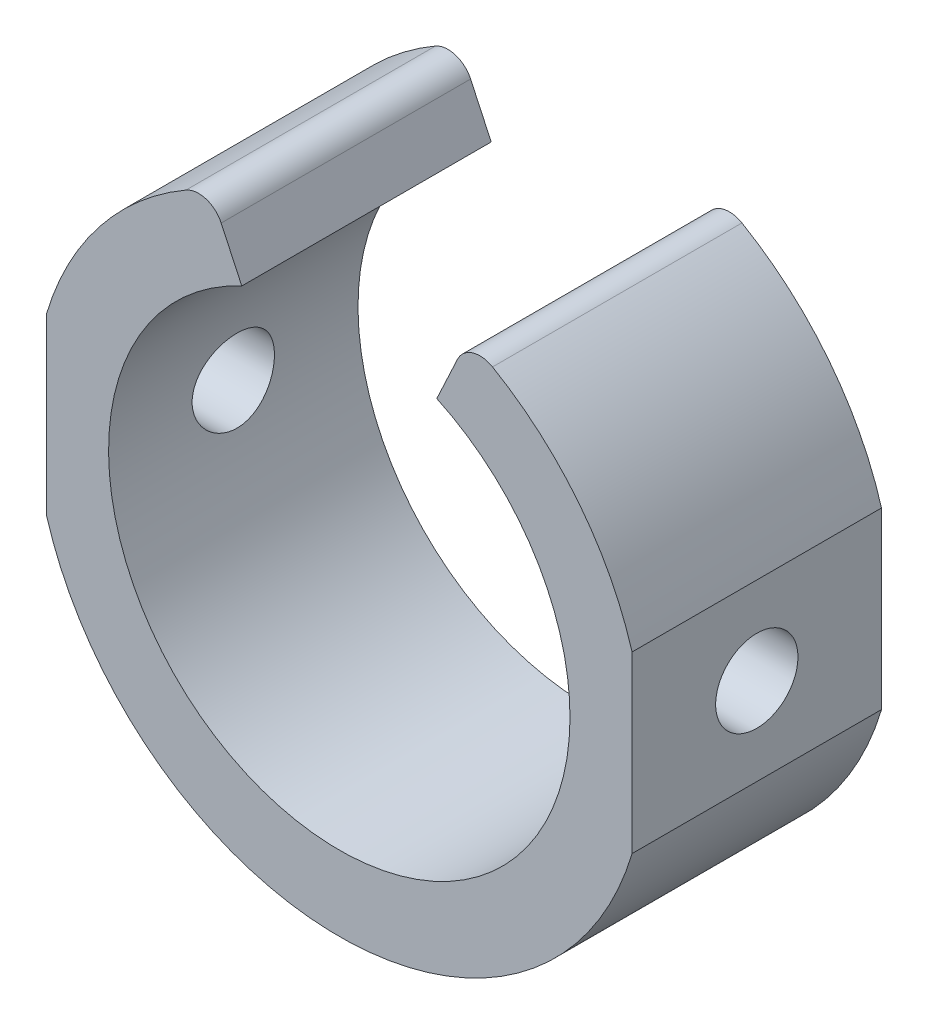
ISO-10303-21;
HEADER;
FILE_DESCRIPTION(('STEP AP214'),'2;1');
FILE_NAME('part.step','',(''),(''),'','','');
FILE_SCHEMA(('AUTOMOTIVE_DESIGN { 1 0 10303 214 1 1 1 1 }'));
ENDSEC;
DATA;
#1=APPLICATION_CONTEXT('core data for automotive mechanical design processes');
#2=APPLICATION_PROTOCOL_DEFINITION('international standard','automotive_design',2000,#1);
#3=PRODUCT_CONTEXT('',#1,'mechanical');
#4=PRODUCT('Part','Part','',(#3));
#5=PRODUCT_RELATED_PRODUCT_CATEGORY('part','',(#4));
#6=PRODUCT_DEFINITION_FORMATION('','',#4);
#7=PRODUCT_DEFINITION_CONTEXT('part definition',#1,'design');
#8=PRODUCT_DEFINITION('design','',#6,#7);
#9=PRODUCT_DEFINITION_SHAPE('','',#8);
#10=(LENGTH_UNIT() NAMED_UNIT(*) SI_UNIT(.MILLI.,.METRE.));
#11=(NAMED_UNIT(*) PLANE_ANGLE_UNIT() SI_UNIT($,.RADIAN.));
#12=(NAMED_UNIT(*) SI_UNIT($,.STERADIAN.) SOLID_ANGLE_UNIT());
#13=UNCERTAINTY_MEASURE_WITH_UNIT(LENGTH_MEASURE(1.E-05),#10,'distance_accuracy_value','');
#14=(GEOMETRIC_REPRESENTATION_CONTEXT(3) GLOBAL_UNCERTAINTY_ASSIGNED_CONTEXT((#13)) GLOBAL_UNIT_ASSIGNED_CONTEXT((#10,
#11,#12)) REPRESENTATION_CONTEXT('',''));
#15=CARTESIAN_POINT('',(0.,0.,0.));
#16=DIRECTION('',(0.,0.,1.));
#17=DIRECTION('',(1.,0.,0.));
#18=AXIS2_PLACEMENT_3D('',#15,#16,#17);
#19=CARTESIAN_POINT('',(0.,0.,10.));
#20=DIRECTION('',(0.,0.,-1.));
#21=DIRECTION('',(-1.,0.,0.));
#22=AXIS2_PLACEMENT_3D('',#19,#20,#21);
#23=CYLINDRICAL_SURFACE('',#22,12.25);
#24=CARTESIAN_POINT('',(0.,0.,10.));
#25=DIRECTION('',(0.,0.,1.));
#26=DIRECTION('',(1.,0.,0.));
#27=AXIS2_PLACEMENT_3D('',#24,#25,#26);
#28=CIRCLE('',#27,12.25);
#29=CARTESIAN_POINT('',(-11.7393568818739,-3.5,10.));
#30=VERTEX_POINT('',#29);
#31=CARTESIAN_POINT('',(11.7393568818739,-3.5,10.));
#32=VERTEX_POINT('',#31);
#33=EDGE_CURVE('E172',#30,#32,#28,.T.);
#34=ORIENTED_EDGE('',*,*,#33,.F.);
#35=DIRECTION('',(0.,0.,1.));
#36=VECTOR('',#35,1.);
#37=CARTESIAN_POINT('',(-11.7393568818739,-3.5,0.));
#38=LINE('',#37,#36);
#39=CARTESIAN_POINT('',(-11.7393568818739,-3.5,0.));
#40=VERTEX_POINT('',#39);
#41=EDGE_CURVE('E127',#40,#30,#38,.T.);
#42=ORIENTED_EDGE('',*,*,#41,.F.);
#43=CARTESIAN_POINT('',(0.,0.,0.));
#44=DIRECTION('',(0.,0.,1.));
#45=DIRECTION('',(1.,0.,0.));
#46=AXIS2_PLACEMENT_3D('',#43,#44,#45);
#47=CIRCLE('',#46,12.25);
#48=CARTESIAN_POINT('',(11.7393568818739,-3.5,0.));
#49=VERTEX_POINT('',#48);
#50=EDGE_CURVE('E117',#40,#49,#47,.T.);
#51=ORIENTED_EDGE('',*,*,#50,.T.);
#52=DIRECTION('',(0.,0.,1.));
#53=VECTOR('',#52,1.);
#54=CARTESIAN_POINT('',(11.7393568818739,-3.5,0.));
#55=LINE('',#54,#53);
#56=EDGE_CURVE('E150',#49,#32,#55,.T.);
#57=ORIENTED_EDGE('',*,*,#56,.T.);
#58=EDGE_LOOP('',(#34,#42,#51,#57));
#59=FACE_BOUND('',#58,.T.);
#60=ADVANCED_FACE('F33',(#59),#23,.T.);
#61=CARTESIAN_POINT('',(11.7393568818739,3.5,0.));
#62=VERTEX_POINT('',#61);
#63=CARTESIAN_POINT('',(6.14344898800786,10.5981382578142,0.));
#64=VERTEX_POINT('',#63);
#65=EDGE_CURVE('E119',#62,#64,#47,.T.);
#66=ORIENTED_EDGE('',*,*,#65,.T.);
#67=DIRECTION('',(0.,0.,-1.));
#68=VECTOR('',#67,1.);
#69=CARTESIAN_POINT('',(6.14344898800786,10.5981382578142,10.));
#70=LINE('',#69,#68);
#71=CARTESIAN_POINT('',(6.14344898800786,10.5981382578142,10.));
#72=VERTEX_POINT('',#71);
#73=EDGE_CURVE('E186',#64,#72,#70,.F.);
#74=ORIENTED_EDGE('',*,*,#73,.T.);
#75=CARTESIAN_POINT('',(11.7393568818739,3.5,10.));
#76=VERTEX_POINT('',#75);
#77=EDGE_CURVE('E116',#76,#72,#28,.T.);
#78=ORIENTED_EDGE('',*,*,#77,.F.);
#79=DIRECTION('',(0.,0.,1.));
#80=VECTOR('',#79,1.);
#81=CARTESIAN_POINT('',(11.7393568818739,3.5,0.));
#82=LINE('',#81,#80);
#83=EDGE_CURVE('E135',#62,#76,#82,.T.);
#84=ORIENTED_EDGE('',*,*,#83,.F.);
#85=EDGE_LOOP('',(#66,#74,#78,#84));
#86=FACE_BOUND('',#85,.T.);
#87=ADVANCED_FACE('F209',(#86),#23,.T.);
#88=CARTESIAN_POINT('',(0.,0.,55.0780573006424));
#89=DIRECTION('',(0.906307787036649,0.422618261740701,0.));
#90=DIRECTION('',(-0.422618261740701,0.906307787036649,0.));
#91=AXIS2_PLACEMENT_3D('',#88,#89,#90);
#92=PLANE('',#91);
#93=DIRECTION('',(-0.422618261740701,0.906307787036649,0.));
#94=VECTOR('',#93,1.);
#95=CARTESIAN_POINT('',(0.,0.,0.));
#96=LINE('',#95,#94);
#97=CARTESIAN_POINT('',(-3.90921892110148,8.38334703008901,0.));
#98=VERTEX_POINT('',#97);
#99=CARTESIAN_POINT('',(-4.73563516113384,10.1556023760599,0.));
#100=VERTEX_POINT('',#99);
#101=EDGE_CURVE('E159',#98,#100,#96,.T.);
#102=ORIENTED_EDGE('',*,*,#101,.T.);
#103=DIRECTION('',(0.,0.,1.));
#104=VECTOR('',#103,1.);
#105=CARTESIAN_POINT('',(-4.73563516113384,10.1556023760599,10.));
#106=LINE('',#105,#104);
#107=CARTESIAN_POINT('',(-4.73563516113384,10.1556023760599,10.));
#108=VERTEX_POINT('',#107);
#109=EDGE_CURVE('E41',#100,#108,#106,.T.);
#110=ORIENTED_EDGE('',*,*,#109,.T.);
#111=DIRECTION('',(-0.422618261740701,0.906307787036649,0.));
#112=VECTOR('',#111,1.);
#113=CARTESIAN_POINT('',(0.,0.,10.));
#114=LINE('',#113,#112);
#115=CARTESIAN_POINT('',(-3.90921892110148,8.38334703008901,10.));
#116=VERTEX_POINT('',#115);
#117=EDGE_CURVE('E162',#116,#108,#114,.T.);
#118=ORIENTED_EDGE('',*,*,#117,.F.);
#119=DIRECTION('',(0.,0.,-1.));
#120=VECTOR('',#119,1.);
#121=CARTESIAN_POINT('',(-3.90921892110148,8.38334703008901,10.));
#122=LINE('',#121,#120);
#123=EDGE_CURVE('E176',#98,#116,#122,.F.);
#124=ORIENTED_EDGE('',*,*,#123,.F.);
#125=EDGE_LOOP('',(#102,#110,#118,#124));
#126=FACE_BOUND('',#125,.T.);
#127=ADVANCED_FACE('F191',(#126),#92,.T.);
#128=CARTESIAN_POINT('',(0.,0.,10.));
#129=DIRECTION('',(0.,0.,1.));
#130=DIRECTION('',(1.,0.,0.));
#131=AXIS2_PLACEMENT_3D('',#128,#129,#130);
#132=PLANE('',#131);
#133=ORIENTED_EDGE('',*,*,#77,.T.);
#134=CARTESIAN_POINT('',(5.64194294817049,9.73298411431917,10.));
#135=DIRECTION('',(0.,0.,1.));
#136=DIRECTION('',(1.,0.,0.));
#137=AXIS2_PLACEMENT_3D('',#134,#135,#136);
#138=CIRCLE('',#137,1.);
#139=CARTESIAN_POINT('',(4.73563516113384,10.1556023760599,10.));
#140=VERTEX_POINT('',#139);
#141=EDGE_CURVE('E189',#72,#140,#138,.T.);
#142=ORIENTED_EDGE('',*,*,#141,.T.);
#143=DIRECTION('',(-0.422618261740701,-0.906307787036649,0.));
#144=VECTOR('',#143,1.);
#145=CARTESIAN_POINT('',(0.,0.,10.));
#146=LINE('',#145,#144);
#147=CARTESIAN_POINT('',(3.90921892110148,8.38334703008901,10.));
#148=VERTEX_POINT('',#147);
#149=EDGE_CURVE('E157',#140,#148,#146,.T.);
#150=ORIENTED_EDGE('',*,*,#149,.T.);
#151=CARTESIAN_POINT('',(0.,0.,10.));
#152=DIRECTION('',(0.,0.,1.));
#153=DIRECTION('',(1.,0.,0.));
#154=AXIS2_PLACEMENT_3D('',#151,#152,#153);
#155=CIRCLE('',#154,9.25);
#156=EDGE_CURVE('E165',#116,#148,#155,.T.);
#157=ORIENTED_EDGE('',*,*,#156,.F.);
#158=ORIENTED_EDGE('',*,*,#117,.T.);
#159=CARTESIAN_POINT('',(-5.64194294817049,9.73298411431917,10.));
#160=DIRECTION('',(0.,0.,1.));
#161=DIRECTION('',(1.,0.,0.));
#162=AXIS2_PLACEMENT_3D('',#159,#160,#161);
#163=CIRCLE('',#162,1.);
#164=CARTESIAN_POINT('',(-6.14344898800786,10.5981382578142,10.));
#165=VERTEX_POINT('',#164);
#166=EDGE_CURVE('E48',#108,#165,#163,.T.);
#167=ORIENTED_EDGE('',*,*,#166,.T.);
#168=CARTESIAN_POINT('',(-11.7393568818739,3.5,10.));
#169=VERTEX_POINT('',#168);
#170=EDGE_CURVE('E170',#165,#169,#28,.T.);
#171=ORIENTED_EDGE('',*,*,#170,.T.);
#172=DIRECTION('',(0.,1.,0.));
#173=VECTOR('',#172,1.);
#174=CARTESIAN_POINT('',(-11.7393568818739,-3.5,10.));
#175=LINE('',#174,#173);
#176=EDGE_CURVE('E126',#30,#169,#175,.T.);
#177=ORIENTED_EDGE('',*,*,#176,.F.);
#178=ORIENTED_EDGE('',*,*,#33,.T.);
#179=DIRECTION('',(0.,-1.,0.));
#180=VECTOR('',#179,1.);
#181=CARTESIAN_POINT('',(11.7393568818739,-3.5,10.));
#182=LINE('',#181,#180);
#183=EDGE_CURVE('E151',#76,#32,#182,.T.);
#184=ORIENTED_EDGE('',*,*,#183,.F.);
#185=EDGE_LOOP('',(#133,#142,#150,#157,#158,#167,#171,#177,#178,#184));
#186=FACE_BOUND('',#185,.T.);
#187=ADVANCED_FACE('F195',(#186),#132,.T.);
#188=CARTESIAN_POINT('',(0.,0.,0.));
#189=DIRECTION('',(0.,0.,1.));
#190=DIRECTION('',(1.,0.,0.));
#191=AXIS2_PLACEMENT_3D('',#188,#189,#190);
#192=PLANE('',#191);
#193=DIRECTION('',(-0.422618261740701,-0.906307787036649,0.));
#194=VECTOR('',#193,1.);
#195=CARTESIAN_POINT('',(0.,0.,0.));
#196=LINE('',#195,#194);
#197=CARTESIAN_POINT('',(4.73563516113384,10.1556023760599,0.));
#198=VERTEX_POINT('',#197);
#199=CARTESIAN_POINT('',(3.90921892110148,8.38334703008901,0.));
#200=VERTEX_POINT('',#199);
#201=EDGE_CURVE('E146',#198,#200,#196,.T.);
#202=ORIENTED_EDGE('',*,*,#201,.F.);
#203=CARTESIAN_POINT('',(5.64194294817049,9.73298411431917,0.));
#204=DIRECTION('',(0.,0.,1.));
#205=DIRECTION('',(1.,0.,0.));
#206=AXIS2_PLACEMENT_3D('',#203,#204,#205);
#207=CIRCLE('',#206,1.);
#208=EDGE_CURVE('E184',#198,#64,#207,.F.);
#209=ORIENTED_EDGE('',*,*,#208,.T.);
#210=ORIENTED_EDGE('',*,*,#65,.F.);
#211=DIRECTION('',(0.,-1.,0.));
#212=VECTOR('',#211,1.);
#213=CARTESIAN_POINT('',(11.7393568818739,-3.5,0.));
#214=LINE('',#213,#212);
#215=EDGE_CURVE('E148',#62,#49,#214,.T.);
#216=ORIENTED_EDGE('',*,*,#215,.T.);
#217=ORIENTED_EDGE('',*,*,#50,.F.);
#218=DIRECTION('',(0.,1.,0.));
#219=VECTOR('',#218,1.);
#220=CARTESIAN_POINT('',(-11.7393568818739,-3.5,0.));
#221=LINE('',#220,#219);
#222=CARTESIAN_POINT('',(-11.7393568818739,3.5,0.));
#223=VERTEX_POINT('',#222);
#224=EDGE_CURVE('E123',#40,#223,#221,.T.);
#225=ORIENTED_EDGE('',*,*,#224,.T.);
#226=CARTESIAN_POINT('',(-6.14344898800786,10.5981382578142,0.));
#227=VERTEX_POINT('',#226);
#228=EDGE_CURVE('E109',#227,#223,#47,.T.);
#229=ORIENTED_EDGE('',*,*,#228,.F.);
#230=CARTESIAN_POINT('',(-5.64194294817049,9.73298411431917,0.));
#231=DIRECTION('',(0.,0.,1.));
#232=DIRECTION('',(1.,0.,0.));
#233=AXIS2_PLACEMENT_3D('',#230,#231,#232);
#234=CIRCLE('',#233,1.);
#235=EDGE_CURVE('E182',#227,#100,#234,.F.);
#236=ORIENTED_EDGE('',*,*,#235,.T.);
#237=ORIENTED_EDGE('',*,*,#101,.F.);
#238=CARTESIAN_POINT('',(0.,0.,0.));
#239=DIRECTION('',(0.,0.,1.));
#240=DIRECTION('',(1.,0.,0.));
#241=AXIS2_PLACEMENT_3D('',#238,#239,#240);
#242=CIRCLE('',#241,9.25);
#243=EDGE_CURVE('E164',#98,#200,#242,.T.);
#244=ORIENTED_EDGE('',*,*,#243,.T.);
#245=EDGE_LOOP('',(#202,#209,#210,#216,#217,#225,#229,#236,#237,#244));
#246=FACE_BOUND('',#245,.T.);
#247=ADVANCED_FACE('F131',(#246),#192,.F.);
#248=ORIENTED_EDGE('',*,*,#170,.F.);
#249=DIRECTION('',(0.,0.,-1.));
#250=VECTOR('',#249,1.);
#251=CARTESIAN_POINT('',(-6.14344898800787,10.5981382578142,10.));
#252=LINE('',#251,#250);
#253=EDGE_CURVE('E11',#165,#227,#252,.T.);
#254=ORIENTED_EDGE('',*,*,#253,.T.);
#255=ORIENTED_EDGE('',*,*,#228,.T.);
#256=DIRECTION('',(0.,0.,1.));
#257=VECTOR('',#256,1.);
#258=CARTESIAN_POINT('',(-11.7393568818739,3.5,0.));
#259=LINE('',#258,#257);
#260=EDGE_CURVE('E112',#223,#169,#259,.T.);
#261=ORIENTED_EDGE('',*,*,#260,.T.);
#262=EDGE_LOOP('',(#248,#254,#255,#261));
#263=FACE_BOUND('',#262,.T.);
#264=ADVANCED_FACE('F111',(#263),#23,.T.);
#265=CARTESIAN_POINT('',(0.,0.,10.));
#266=DIRECTION('',(0.,0.,-1.));
#267=DIRECTION('',(-1.,0.,0.));
#268=AXIS2_PLACEMENT_3D('',#265,#266,#267);
#269=CYLINDRICAL_SURFACE('',#268,9.25);
#270=CARTESIAN_POINT('',(-9.25,0.,3.35));
#271=CARTESIAN_POINT('',(-9.24999836922532,0.0918997979682044,3.35000359381437));
#272=CARTESIAN_POINT('',(-9.24861625024695,0.183847309670374,3.35770373585169));
#273=CARTESIAN_POINT('',(-9.24323586136525,0.365156805688511,3.38828420185374));
#274=CARTESIAN_POINT('',(-9.23923529416177,0.454516447574823,3.4111778561196));
#275=CARTESIAN_POINT('',(-9.22906606708025,0.628001372820011,3.47142656772143));
#276=CARTESIAN_POINT('',(-9.22289928274691,0.712131110384352,3.50876911780727));
#277=CARTESIAN_POINT('',(-9.20907312225814,0.872921967465005,3.59682131545076));
#278=CARTESIAN_POINT('',(-9.20141388932518,0.949583802578722,3.64752968052585));
#279=CARTESIAN_POINT('',(-9.18535665099785,1.09410642632481,3.76146066402258));
#280=CARTESIAN_POINT('',(-9.17695217146245,1.16187413079374,3.82480046060807));
#281=CARTESIAN_POINT('',(-9.16040039998216,1.28588008020984,3.96194417170102));
#282=CARTESIAN_POINT('',(-9.15225312550035,1.34211754372351,4.03574879486314));
#283=CARTESIAN_POINT('',(-9.13707543144646,1.44184746981382,4.19237671235467));
#284=CARTESIAN_POINT('',(-9.13005336860632,1.48524642821299,4.27526042452001));
#285=CARTESIAN_POINT('',(-9.11801179157205,1.55746912226431,4.44728817556047));
#286=CARTESIAN_POINT('',(-9.11299212174606,1.58629399070399,4.53643172726895));
#287=CARTESIAN_POINT('',(-9.10558854100588,1.62825396944434,4.71745676868841));
#288=CARTESIAN_POINT('',(-9.10317749915987,1.64155069721199,4.80929966579106));
#289=CARTESIAN_POINT('',(-9.10118224863779,1.65257835281212,4.99394210183278));
#290=CARTESIAN_POINT('',(-9.10159781073693,1.65031054285797,5.08674156258947));
#291=CARTESIAN_POINT('',(-9.10518408100095,1.63040481488376,5.26949980608475));
#292=CARTESIAN_POINT('',(-9.10832202639299,1.6129496631306,5.3594792326621));
#293=CARTESIAN_POINT('',(-9.11694811606599,1.56345211381193,5.53521163658583));
#294=CARTESIAN_POINT('',(-9.12243635156752,1.53140915005431,5.62096444974282));
#295=CARTESIAN_POINT('',(-9.13517940216681,1.45346387035144,5.78634976787878));
#296=CARTESIAN_POINT('',(-9.14244370240897,1.40748681200442,5.86594628617866));
#297=CARTESIAN_POINT('',(-9.15791397029176,1.30303141423086,6.0163637163303));
#298=CARTESIAN_POINT('',(-9.16612002466117,1.24455192299148,6.08718381868612));
#299=CARTESIAN_POINT('',(-9.18269249141173,1.11576157612994,6.21909497117515));
#300=CARTESIAN_POINT('',(-9.19105952380299,1.04529417178967,6.28003320157337));
#301=CARTESIAN_POINT('',(-9.20690357942113,0.89505467702135,6.38924504261922));
#302=CARTESIAN_POINT('',(-9.21438059525683,0.81528250933245,6.43751854809621));
#303=CARTESIAN_POINT('',(-9.22761515281932,0.64854562866143,6.52004923466589));
#304=CARTESIAN_POINT('',(-9.23337087585211,0.561573431202276,6.55429160469309));
#305=CARTESIAN_POINT('',(-9.24250005740706,0.382986392459913,6.60763925158701));
#306=CARTESIAN_POINT('',(-9.24587374462114,0.291371997765152,6.62674598160143));
#307=CARTESIAN_POINT('',(-9.24982761790757,0.107417000098619,6.64906977689608));
#308=CARTESIAN_POINT('',(-9.25044464439958,0.0151025942353393,6.65249640844869));
#309=CARTESIAN_POINT('',(-9.24891704949468,-0.168780564468838,6.64392332840571));
#310=CARTESIAN_POINT('',(-9.24677255041716,-0.260349350155549,6.63192430007638));
#311=CARTESIAN_POINT('',(-9.23998573872083,-0.439485109122564,6.59301478863349));
#312=CARTESIAN_POINT('',(-9.23536102260626,-0.527075615458675,6.56620931379664));
#313=CARTESIAN_POINT('',(-9.22413017196302,-0.6965194319323,6.49856068739043));
#314=CARTESIAN_POINT('',(-9.21752391311633,-0.778372381709446,6.45771665504675));
#315=CARTESIAN_POINT('',(-9.20297099940288,-0.934919170605692,6.36267921952414));
#316=CARTESIAN_POINT('',(-9.1950116074203,-1.0095332785903,6.30835647153927));
#317=CARTESIAN_POINT('',(-9.17867051751854,-1.14866160977653,6.18807995345791));
#318=CARTESIAN_POINT('',(-9.17028878419397,-1.21317498435345,6.12212520707456));
#319=CARTESIAN_POINT('',(-9.15392685239092,-1.33105810692588,5.97951204929827));
#320=CARTESIAN_POINT('',(-9.14595264967893,-1.38428546552957,5.90273514014055));
#321=CARTESIAN_POINT('',(-9.13142529507707,-1.47708753921411,5.74120662518949));
#322=CARTESIAN_POINT('',(-9.12487209366024,-1.51666273015008,5.65645529748075));
#323=CARTESIAN_POINT('',(-9.11397484864333,-1.58083015445106,5.4817617378071));
#324=CARTESIAN_POINT('',(-9.1096208245227,-1.60549017989111,5.39184505807344));
#325=CARTESIAN_POINT('',(-9.10359107311207,-1.63933838177875,5.20906059654922));
#326=CARTESIAN_POINT('',(-9.1019150753599,-1.64852812062342,5.11619311373566));
#327=CARTESIAN_POINT('',(-9.10144393764117,-1.65112650972303,4.93156740374906));
#328=CARTESIAN_POINT('',(-9.10260783780944,-1.64475953275712,4.83981236287588));
#329=CARTESIAN_POINT('',(-9.10759500672655,-1.61691371565156,4.65870222295935));
#330=CARTESIAN_POINT('',(-9.11141826303993,-1.59543494617642,4.56934711269566));
#331=CARTESIAN_POINT('',(-9.12127686349376,-1.5380660425511,4.39567869943604));
#332=CARTESIAN_POINT('',(-9.12730882072937,-1.50219796549642,4.31135790566937));
#333=CARTESIAN_POINT('',(-9.14090794017928,-1.41709242535106,4.14989467708277));
#334=CARTESIAN_POINT('',(-9.14847519644177,-1.36785414317593,4.07275268243876));
#335=CARTESIAN_POINT('',(-9.16442065634268,-1.25661643595524,3.92670846294826));
#336=CARTESIAN_POINT('',(-9.1728084718426,-1.1944528945154,3.85793227034624));
#337=CARTESIAN_POINT('',(-9.18937593301058,-1.05947343032675,3.73171171396741));
#338=CARTESIAN_POINT('',(-9.19755553035082,-0.986655060565695,3.67426996042009));
#339=CARTESIAN_POINT('',(-9.21286165686665,-0.831734141449389,3.57192153317675));
#340=CARTESIAN_POINT('',(-9.21997919658957,-0.749561695192976,3.52711928696136));
#341=CARTESIAN_POINT('',(-9.2322717227349,-0.578759075253653,3.45202587442574));
#342=CARTESIAN_POINT('',(-9.23744858276265,-0.490135229247231,3.42172070423559));
#343=CARTESIAN_POINT('',(-9.24418724421041,-0.334343050161219,3.3828279762045));
#344=CARTESIAN_POINT('',(-9.24635501806177,-0.268100484356164,3.37053791803837));
#345=CARTESIAN_POINT('',(-9.24926197776415,-0.134580461119089,3.35412270165897));
#346=CARTESIAN_POINT('',(-9.25000119430154,-0.0673030259480522,3.34999736806188));
#347=CARTESIAN_POINT('',(-9.25,0.,3.35));
#348=B_SPLINE_CURVE_WITH_KNOTS('',3,(#270,#271,#272,#273,#274,#275,#276,#277,#278,#279,#280,
#281,#282,#283,#284,#285,#286,#287,#288,#289,#290,#291,#292,#293,#294,#295,#296,#297,#298,#299,
#300,#301,#302,#303,#304,#305,#306,#307,#308,#309,#310,#311,#312,#313,#314,#315,#316,#317,#318,
#319,#320,#321,#322,#323,#324,#325,#326,#327,#328,#329,#330,#331,#332,#333,#334,#335,#336,#337,
#338,#339,#340,#341,#342,#343,#344,#345,#346,#347),.UNSPECIFIED.,.T.,.F.,(4,2,2,2,2,2,2,2,2,2,2,
2,2,2,2,2,2,2,2,2,2,2,2,2,2,2,2,2,2,2,2,2,2,2,2,2,2,2,4),(0.,0.275453317310807,
0.551148628606123,0.826605824558165,1.10203659933566,1.38015245752402,1.65828715809927,
1.93840030604334,2.21849167852974,2.49564110844262,2.77276806306048,3.04660545682163,
3.32045347985289,3.59579723184091,3.8711663613887,4.15045480849296,4.42974557479625,
4.70933040163167,4.98888838273698,5.26469891306928,5.54049722703344,5.81436421863806,
6.08824839570193,6.36487000499944,6.64151484252197,6.92146581228377,7.2014070231876,
7.48006609809179,7.75869702857569,8.03333307911378,8.30796784543002,8.58218322816302,
8.85641541364857,9.13436928187787,9.41238708611598,9.69263875523168,9.97261915772498,
10.1743523542294,10.3760812173207),.UNSPECIFIED.);
#349=CARTESIAN_POINT('',(-9.25,0.,3.35));
#350=VERTEX_POINT('',#349);
#351=EDGE_CURVE('E138',#350,#350,#348,.T.);
#352=ORIENTED_EDGE('',*,*,#351,.F.);
#353=EDGE_LOOP('',(#352));
#354=FACE_BOUND('',#353,.T.);
#355=CARTESIAN_POINT('',(9.25,0.,3.35));
#356=CARTESIAN_POINT('',(9.24999836922532,-0.0918997979682044,3.35000359381437));
#357=CARTESIAN_POINT('',(9.24861625024695,-0.183847309670374,3.35770373585169));
#358=CARTESIAN_POINT('',(9.24323586136525,-0.365156805688511,3.38828420185374));
#359=CARTESIAN_POINT('',(9.23923529416177,-0.454516447574823,3.4111778561196));
#360=CARTESIAN_POINT('',(9.22906606708025,-0.628001372820011,3.47142656772143));
#361=CARTESIAN_POINT('',(9.22289928274691,-0.712131110384352,3.50876911780727));
#362=CARTESIAN_POINT('',(9.20907312225814,-0.872921967465005,3.59682131545076));
#363=CARTESIAN_POINT('',(9.20141388932518,-0.949583802578722,3.64752968052585));
#364=CARTESIAN_POINT('',(9.18535665099785,-1.09410642632481,3.76146066402258));
#365=CARTESIAN_POINT('',(9.17695217146245,-1.16187413079374,3.82480046060807));
#366=CARTESIAN_POINT('',(9.16040039998216,-1.28588008020984,3.96194417170102));
#367=CARTESIAN_POINT('',(9.15225312550035,-1.34211754372351,4.03574879486314));
#368=CARTESIAN_POINT('',(9.13707543144646,-1.44184746981382,4.19237671235467));
#369=CARTESIAN_POINT('',(9.13005336860632,-1.48524642821299,4.27526042452001));
#370=CARTESIAN_POINT('',(9.11801179157205,-1.55746912226431,4.44728817556047));
#371=CARTESIAN_POINT('',(9.11299212174606,-1.58629399070399,4.53643172726895));
#372=CARTESIAN_POINT('',(9.10558854100588,-1.62825396944434,4.71745676868841));
#373=CARTESIAN_POINT('',(9.10317749915987,-1.64155069721199,4.80929966579106));
#374=CARTESIAN_POINT('',(9.10118224863779,-1.65257835281212,4.99394210183278));
#375=CARTESIAN_POINT('',(9.10159781073693,-1.65031054285797,5.08674156258947));
#376=CARTESIAN_POINT('',(9.10518408100095,-1.63040481488376,5.26949980608475));
#377=CARTESIAN_POINT('',(9.10832202639299,-1.6129496631306,5.3594792326621));
#378=CARTESIAN_POINT('',(9.11694811606599,-1.56345211381193,5.53521163658583));
#379=CARTESIAN_POINT('',(9.12243635156752,-1.53140915005431,5.62096444974282));
#380=CARTESIAN_POINT('',(9.13517940216681,-1.45346387035144,5.78634976787878));
#381=CARTESIAN_POINT('',(9.14244370240897,-1.40748681200442,5.86594628617866));
#382=CARTESIAN_POINT('',(9.15791397029176,-1.30303141423086,6.0163637163303));
#383=CARTESIAN_POINT('',(9.16612002466117,-1.24455192299148,6.08718381868612));
#384=CARTESIAN_POINT('',(9.18269249141173,-1.11576157612994,6.21909497117515));
#385=CARTESIAN_POINT('',(9.19105952380299,-1.04529417178967,6.28003320157337));
#386=CARTESIAN_POINT('',(9.20690357942113,-0.89505467702135,6.38924504261922));
#387=CARTESIAN_POINT('',(9.21438059525683,-0.81528250933245,6.43751854809621));
#388=CARTESIAN_POINT('',(9.22761515281932,-0.64854562866143,6.52004923466589));
#389=CARTESIAN_POINT('',(9.23337087585211,-0.561573431202276,6.55429160469309));
#390=CARTESIAN_POINT('',(9.24250005740706,-0.382986392459913,6.60763925158701));
#391=CARTESIAN_POINT('',(9.24587374462114,-0.291371997765152,6.62674598160143));
#392=CARTESIAN_POINT('',(9.24982761790757,-0.107417000098619,6.64906977689608));
#393=CARTESIAN_POINT('',(9.25044464439958,-0.0151025942353393,6.65249640844869));
#394=CARTESIAN_POINT('',(9.24891704949468,0.168780564468838,6.64392332840571));
#395=CARTESIAN_POINT('',(9.24677255041716,0.260349350155549,6.63192430007638));
#396=CARTESIAN_POINT('',(9.23998573872083,0.439485109122564,6.59301478863349));
#397=CARTESIAN_POINT('',(9.23536102260626,0.527075615458675,6.56620931379664));
#398=CARTESIAN_POINT('',(9.22413017196302,0.6965194319323,6.49856068739043));
#399=CARTESIAN_POINT('',(9.21752391311633,0.778372381709446,6.45771665504675));
#400=CARTESIAN_POINT('',(9.20297099940288,0.934919170605692,6.36267921952414));
#401=CARTESIAN_POINT('',(9.1950116074203,1.0095332785903,6.30835647153927));
#402=CARTESIAN_POINT('',(9.17867051751854,1.14866160977653,6.18807995345791));
#403=CARTESIAN_POINT('',(9.17028878419397,1.21317498435345,6.12212520707456));
#404=CARTESIAN_POINT('',(9.15392685239092,1.33105810692588,5.97951204929827));
#405=CARTESIAN_POINT('',(9.14595264967893,1.38428546552957,5.90273514014055));
#406=CARTESIAN_POINT('',(9.13142529507707,1.47708753921411,5.74120662518949));
#407=CARTESIAN_POINT('',(9.12487209366024,1.51666273015008,5.65645529748075));
#408=CARTESIAN_POINT('',(9.11397484864333,1.58083015445106,5.4817617378071));
#409=CARTESIAN_POINT('',(9.1096208245227,1.60549017989111,5.39184505807344));
#410=CARTESIAN_POINT('',(9.10359107311207,1.63933838177875,5.20906059654922));
#411=CARTESIAN_POINT('',(9.1019150753599,1.64852812062342,5.11619311373566));
#412=CARTESIAN_POINT('',(9.10144393764117,1.65112650972303,4.93156740374906));
#413=CARTESIAN_POINT('',(9.10260783780944,1.64475953275712,4.83981236287588));
#414=CARTESIAN_POINT('',(9.10759500672655,1.61691371565156,4.65870222295935));
#415=CARTESIAN_POINT('',(9.11141826303993,1.59543494617642,4.56934711269566));
#416=CARTESIAN_POINT('',(9.12127686349376,1.5380660425511,4.39567869943604));
#417=CARTESIAN_POINT('',(9.12730882072937,1.50219796549642,4.31135790566937));
#418=CARTESIAN_POINT('',(9.14090794017928,1.41709242535106,4.14989467708277));
#419=CARTESIAN_POINT('',(9.14847519644177,1.36785414317593,4.07275268243876));
#420=CARTESIAN_POINT('',(9.16442065634268,1.25661643595524,3.92670846294826));
#421=CARTESIAN_POINT('',(9.1728084718426,1.1944528945154,3.85793227034624));
#422=CARTESIAN_POINT('',(9.18937593301058,1.05947343032675,3.73171171396741));
#423=CARTESIAN_POINT('',(9.19755553035082,0.986655060565695,3.67426996042009));
#424=CARTESIAN_POINT('',(9.21286165686665,0.831734141449389,3.57192153317675));
#425=CARTESIAN_POINT('',(9.21997919658957,0.749561695192976,3.52711928696136));
#426=CARTESIAN_POINT('',(9.2322717227349,0.578759075253653,3.45202587442574));
#427=CARTESIAN_POINT('',(9.23744858276265,0.490135229247231,3.42172070423559));
#428=CARTESIAN_POINT('',(9.24418724421041,0.334343050161219,3.3828279762045));
#429=CARTESIAN_POINT('',(9.24635501806177,0.268100484356164,3.37053791803837));
#430=CARTESIAN_POINT('',(9.24926197776415,0.134580461119089,3.35412270165897));
#431=CARTESIAN_POINT('',(9.25000119430154,0.0673030259480522,3.34999736806188));
#432=CARTESIAN_POINT('',(9.25,0.,3.35));
#433=B_SPLINE_CURVE_WITH_KNOTS('',3,(#355,#356,#357,#358,#359,#360,#361,#362,#363,#364,#365,
#366,#367,#368,#369,#370,#371,#372,#373,#374,#375,#376,#377,#378,#379,#380,#381,#382,#383,#384,
#385,#386,#387,#388,#389,#390,#391,#392,#393,#394,#395,#396,#397,#398,#399,#400,#401,#402,#403,
#404,#405,#406,#407,#408,#409,#410,#411,#412,#413,#414,#415,#416,#417,#418,#419,#420,#421,#422,
#423,#424,#425,#426,#427,#428,#429,#430,#431,#432),.UNSPECIFIED.,.T.,.F.,(4,2,2,2,2,2,2,2,2,2,2,
2,2,2,2,2,2,2,2,2,2,2,2,2,2,2,2,2,2,2,2,2,2,2,2,2,2,2,4),(0.,0.275453317310807,
0.551148628606123,0.826605824558165,1.10203659933566,1.38015245752402,1.65828715809927,
1.93840030604334,2.21849167852974,2.49564110844262,2.77276806306048,3.04660545682163,
3.32045347985289,3.59579723184091,3.8711663613887,4.15045480849296,4.42974557479625,
4.70933040163167,4.98888838273698,5.26469891306928,5.54049722703344,5.81436421863806,
6.08824839570193,6.36487000499944,6.64151484252197,6.92146581228377,7.2014070231876,
7.48006609809179,7.75869702857569,8.03333307911378,8.30796784543002,8.58218322816302,
8.85641541364857,9.13436928187787,9.41238708611598,9.69263875523168,9.97261915772498,
10.1743523542294,10.3760812173207),.UNSPECIFIED.);
#434=CARTESIAN_POINT('',(9.25,0.,3.35));
#435=VERTEX_POINT('',#434);
#436=EDGE_CURVE('E233',#435,#435,#433,.T.);
#437=ORIENTED_EDGE('',*,*,#436,.F.);
#438=EDGE_LOOP('',(#437));
#439=FACE_BOUND('',#438,.T.);
#440=ORIENTED_EDGE('',*,*,#243,.F.);
#441=ORIENTED_EDGE('',*,*,#123,.T.);
#442=ORIENTED_EDGE('',*,*,#156,.T.);
#443=DIRECTION('',(0.,0.,-1.));
#444=VECTOR('',#443,1.);
#445=CARTESIAN_POINT('',(3.90921892110148,8.38334703008901,10.));
#446=LINE('',#445,#444);
#447=EDGE_CURVE('E171',#148,#200,#446,.T.);
#448=ORIENTED_EDGE('',*,*,#447,.T.);
#449=EDGE_LOOP('',(#440,#441,#442,#448));
#450=FACE_BOUND('',#449,.T.);
#451=ADVANCED_FACE('F200',(#354,#439,#450),#269,.F.);
#452=CARTESIAN_POINT('',(0.,0.,55.0780573006424));
#453=DIRECTION('',(-0.906307787036649,0.422618261740701,0.));
#454=DIRECTION('',(-0.422618261740701,-0.906307787036649,0.));
#455=AXIS2_PLACEMENT_3D('',#452,#453,#454);
#456=PLANE('',#455);
#457=ORIENTED_EDGE('',*,*,#149,.F.);
#458=DIRECTION('',(0.,0.,1.));
#459=VECTOR('',#458,1.);
#460=CARTESIAN_POINT('',(4.73563516113384,10.1556023760599,0.));
#461=LINE('',#460,#459);
#462=EDGE_CURVE('E179',#140,#198,#461,.F.);
#463=ORIENTED_EDGE('',*,*,#462,.T.);
#464=ORIENTED_EDGE('',*,*,#201,.T.);
#465=ORIENTED_EDGE('',*,*,#447,.F.);
#466=EDGE_LOOP('',(#457,#463,#464,#465));
#467=FACE_BOUND('',#466,.T.);
#468=ADVANCED_FACE('F223',(#467),#456,.T.);
#469=CARTESIAN_POINT('',(11.7393568818739,-3.5,0.));
#470=DIRECTION('',(-1.,0.,0.));
#471=DIRECTION('',(0.,0.,1.));
#472=AXIS2_PLACEMENT_3D('',#469,#470,#471);
#473=PLANE('',#472);
#474=CARTESIAN_POINT('',(11.7393568818739,0.,5.));
#475=DIRECTION('',(1.,0.,0.));
#476=DIRECTION('',(0.,0.,-1.));
#477=AXIS2_PLACEMENT_3D('',#474,#475,#476);
#478=CIRCLE('',#477,1.65);
#479=CARTESIAN_POINT('',(11.7393568818739,0.,3.35));
#480=VERTEX_POINT('',#479);
#481=EDGE_CURVE('E240',#480,#480,#478,.T.);
#482=ORIENTED_EDGE('',*,*,#481,.F.);
#483=EDGE_LOOP('',(#482));
#484=FACE_BOUND('',#483,.T.);
#485=ORIENTED_EDGE('',*,*,#183,.T.);
#486=ORIENTED_EDGE('',*,*,#56,.F.);
#487=ORIENTED_EDGE('',*,*,#215,.F.);
#488=ORIENTED_EDGE('',*,*,#83,.T.);
#489=EDGE_LOOP('',(#485,#486,#487,#488));
#490=FACE_BOUND('',#489,.T.);
#491=ADVANCED_FACE('F250',(#484,#490),#473,.F.);
#492=CARTESIAN_POINT('',(-11.7393568818739,-3.5,0.));
#493=DIRECTION('',(1.,0.,0.));
#494=DIRECTION('',(0.,0.,-1.));
#495=AXIS2_PLACEMENT_3D('',#492,#493,#494);
#496=PLANE('',#495);
#497=CARTESIAN_POINT('',(-11.7393568818739,0.,5.));
#498=DIRECTION('',(1.,0.,0.));
#499=DIRECTION('',(0.,0.,-1.));
#500=AXIS2_PLACEMENT_3D('',#497,#498,#499);
#501=CIRCLE('',#500,1.65);
#502=CARTESIAN_POINT('',(-11.7393568818739,0.,3.35));
#503=VERTEX_POINT('',#502);
#504=EDGE_CURVE('E239',#503,#503,#501,.T.);
#505=ORIENTED_EDGE('',*,*,#504,.T.);
#506=EDGE_LOOP('',(#505));
#507=FACE_BOUND('',#506,.T.);
#508=ORIENTED_EDGE('',*,*,#176,.T.);
#509=ORIENTED_EDGE('',*,*,#260,.F.);
#510=ORIENTED_EDGE('',*,*,#224,.F.);
#511=ORIENTED_EDGE('',*,*,#41,.T.);
#512=EDGE_LOOP('',(#508,#509,#510,#511));
#513=FACE_BOUND('',#512,.T.);
#514=ADVANCED_FACE('F122',(#507,#513),#496,.F.);
#515=CARTESIAN_POINT('',(-11.7393568818739,0.,5.));
#516=DIRECTION('',(1.,0.,0.));
#517=DIRECTION('',(0.,0.,-1.));
#518=AXIS2_PLACEMENT_3D('',#515,#516,#517);
#519=CYLINDRICAL_SURFACE('',#518,1.65);
#520=ORIENTED_EDGE('',*,*,#351,.T.);
#521=EDGE_LOOP('',(#520));
#522=FACE_BOUND('',#521,.T.);
#523=ORIENTED_EDGE('',*,*,#504,.F.);
#524=EDGE_LOOP('',(#523));
#525=FACE_BOUND('',#524,.T.);
#526=ADVANCED_FACE('F245',(#522,#525),#519,.F.);
#527=ORIENTED_EDGE('',*,*,#436,.T.);
#528=EDGE_LOOP('',(#527));
#529=FACE_BOUND('',#528,.T.);
#530=ORIENTED_EDGE('',*,*,#481,.T.);
#531=EDGE_LOOP('',(#530));
#532=FACE_BOUND('',#531,.T.);
#533=ADVANCED_FACE('F206',(#529,#532),#519,.F.);
#534=CARTESIAN_POINT('',(5.64194294817049,9.73298411431917,10.));
#535=DIRECTION('',(0.,0.,-1.));
#536=DIRECTION('',(-1.,0.,0.));
#537=AXIS2_PLACEMENT_3D('',#534,#535,#536);
#538=CYLINDRICAL_SURFACE('',#537,1.);
#539=ORIENTED_EDGE('',*,*,#141,.F.);
#540=ORIENTED_EDGE('',*,*,#73,.F.);
#541=ORIENTED_EDGE('',*,*,#208,.F.);
#542=ORIENTED_EDGE('',*,*,#462,.F.);
#543=EDGE_LOOP('',(#539,#540,#541,#542));
#544=FACE_BOUND('',#543,.T.);
#545=ADVANCED_FACE('F202',(#544),#538,.T.);
#546=CARTESIAN_POINT('',(-5.64194294817049,9.73298411431917,10.));
#547=DIRECTION('',(0.,0.,-1.));
#548=DIRECTION('',(-1.,0.,0.));
#549=AXIS2_PLACEMENT_3D('',#546,#547,#548);
#550=CYLINDRICAL_SURFACE('',#549,1.);
#551=ORIENTED_EDGE('',*,*,#235,.F.);
#552=ORIENTED_EDGE('',*,*,#253,.F.);
#553=ORIENTED_EDGE('',*,*,#166,.F.);
#554=ORIENTED_EDGE('',*,*,#109,.F.);
#555=EDGE_LOOP('',(#551,#552,#553,#554));
#556=FACE_BOUND('',#555,.T.);
#557=ADVANCED_FACE('F35',(#556),#550,.T.);
#558=CLOSED_SHELL('',(#60,#87,#127,#187,#247,#264,#451,#468,#491,#514,#526,#533,#545,#557));
#559=MANIFOLD_SOLID_BREP('B2',#558);
#560=ADVANCED_BREP_SHAPE_REPRESENTATION('',(#18,#559),#14);
#561=SHAPE_DEFINITION_REPRESENTATION(#9,#560);
ENDSEC;
END-ISO-10303-21;
